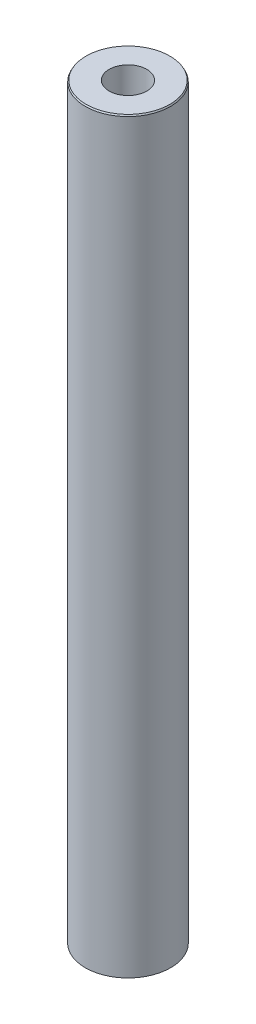
ISO-10303-21;
HEADER;
FILE_DESCRIPTION(('STEP AP214'),'2;1');
FILE_NAME('part.step','',(''),(''),'','','');
FILE_SCHEMA(('AUTOMOTIVE_DESIGN { 1 0 10303 214 1 1 1 1 }'));
ENDSEC;
DATA;
#1=APPLICATION_CONTEXT('core data for automotive mechanical design processes');
#2=APPLICATION_PROTOCOL_DEFINITION('international standard','automotive_design',2000,#1);
#3=PRODUCT_CONTEXT('',#1,'mechanical');
#4=PRODUCT('Part','Part','',(#3));
#5=PRODUCT_RELATED_PRODUCT_CATEGORY('part','',(#4));
#6=PRODUCT_DEFINITION_FORMATION('','',#4);
#7=PRODUCT_DEFINITION_CONTEXT('part definition',#1,'design');
#8=PRODUCT_DEFINITION('design','',#6,#7);
#9=PRODUCT_DEFINITION_SHAPE('','',#8);
#10=(LENGTH_UNIT() NAMED_UNIT(*) SI_UNIT(.MILLI.,.METRE.));
#11=(NAMED_UNIT(*) PLANE_ANGLE_UNIT() SI_UNIT($,.RADIAN.));
#12=(NAMED_UNIT(*) SI_UNIT($,.STERADIAN.) SOLID_ANGLE_UNIT());
#13=UNCERTAINTY_MEASURE_WITH_UNIT(LENGTH_MEASURE(1.E-05),#10,'distance_accuracy_value','');
#14=(GEOMETRIC_REPRESENTATION_CONTEXT(3) GLOBAL_UNCERTAINTY_ASSIGNED_CONTEXT((#13)) GLOBAL_UNIT_ASSIGNED_CONTEXT((#10,
#11,#12)) REPRESENTATION_CONTEXT('',''));
#15=CARTESIAN_POINT('',(0.,0.,0.));
#16=DIRECTION('',(0.,0.,1.));
#17=DIRECTION('',(1.,0.,0.));
#18=AXIS2_PLACEMENT_3D('',#15,#16,#17);
#19=CARTESIAN_POINT('',(0.,175.328501605304,0.));
#20=DIRECTION('',(0.,-1.,0.));
#21=DIRECTION('',(0.,0.,-1.));
#22=AXIS2_PLACEMENT_3D('',#19,#20,#21);
#23=CYLINDRICAL_SURFACE('',#22,10.);
#24=CARTESIAN_POINT('',(0.,175.005196018017,0.));
#25=DIRECTION('',(0.,1.,0.));
#26=DIRECTION('',(0.,0.,1.));
#27=AXIS2_PLACEMENT_3D('',#24,#25,#26);
#28=CIRCLE('',#27,10.);
#29=CARTESIAN_POINT('',(0.,175.005196018017,10.));
#30=VERTEX_POINT('',#29);
#31=EDGE_CURVE('E50',#30,#30,#28,.F.);
#32=ORIENTED_EDGE('',*,*,#31,.T.);
#33=EDGE_LOOP('',(#32));
#34=FACE_BOUND('',#33,.T.);
#35=CARTESIAN_POINT('',(0.,0.186660567850938,0.));
#36=DIRECTION('',(0.,1.,0.));
#37=DIRECTION('',(0.,0.,1.));
#38=AXIS2_PLACEMENT_3D('',#35,#36,#37);
#39=CIRCLE('',#38,10.);
#40=CARTESIAN_POINT('',(0.,0.186660567850938,10.));
#41=VERTEX_POINT('',#40);
#42=EDGE_CURVE('E51',#41,#41,#39,.T.);
#43=ORIENTED_EDGE('',*,*,#42,.T.);
#44=EDGE_LOOP('',(#43));
#45=FACE_BOUND('',#44,.T.);
#46=ADVANCED_FACE('F39',(#34,#45),#23,.T.);
#47=CARTESIAN_POINT('',(0.,175.328501605304,0.));
#48=DIRECTION('',(0.,1.,0.));
#49=DIRECTION('',(0.,0.,1.));
#50=AXIS2_PLACEMENT_3D('',#47,#48,#49);
#51=PLANE('',#50);
#52=CARTESIAN_POINT('',(0.,175.328501605304,0.));
#53=DIRECTION('',(0.,1.,0.));
#54=DIRECTION('',(0.,0.,1.));
#55=AXIS2_PLACEMENT_3D('',#52,#53,#54);
#56=CIRCLE('',#55,9.81333943214904);
#57=CARTESIAN_POINT('',(0.,175.328501605304,9.81333943214904));
#58=VERTEX_POINT('',#57);
#59=EDGE_CURVE('E54',#58,#58,#56,.T.);
#60=ORIENTED_EDGE('',*,*,#59,.T.);
#61=EDGE_LOOP('',(#60));
#62=FACE_BOUND('',#61,.T.);
#63=CARTESIAN_POINT('',(0.,175.328501605304,0.));
#64=DIRECTION('',(0.,1.,0.));
#65=DIRECTION('',(0.,0.,1.));
#66=AXIS2_PLACEMENT_3D('',#63,#64,#65);
#67=CIRCLE('',#66,4.41394839885465);
#68=CARTESIAN_POINT('',(0.,175.328501605304,4.41394839885465));
#69=VERTEX_POINT('',#68);
#70=EDGE_CURVE('E58',#69,#69,#67,.T.);
#71=ORIENTED_EDGE('',*,*,#70,.F.);
#72=EDGE_LOOP('',(#71));
#73=FACE_BOUND('',#72,.T.);
#74=ADVANCED_FACE('F69',(#62,#73),#51,.T.);
#75=CARTESIAN_POINT('',(0.,0.,0.));
#76=DIRECTION('',(0.,1.,0.));
#77=DIRECTION('',(0.,0.,1.));
#78=AXIS2_PLACEMENT_3D('',#75,#76,#77);
#79=PLANE('',#78);
#80=CARTESIAN_POINT('',(0.,0.,0.));
#81=DIRECTION('',(0.,1.,0.));
#82=DIRECTION('',(0.,0.,1.));
#83=AXIS2_PLACEMENT_3D('',#80,#81,#82);
#84=CIRCLE('',#83,9.67669441271252);
#85=CARTESIAN_POINT('',(0.,0.,9.67669441271252));
#86=VERTEX_POINT('',#85);
#87=EDGE_CURVE('E10',#86,#86,#84,.F.);
#88=ORIENTED_EDGE('',*,*,#87,.T.);
#89=EDGE_LOOP('',(#88));
#90=FACE_BOUND('',#89,.T.);
#91=CARTESIAN_POINT('',(0.,0.,0.));
#92=DIRECTION('',(0.,1.,0.));
#93=DIRECTION('',(0.,0.,1.));
#94=AXIS2_PLACEMENT_3D('',#91,#92,#93);
#95=CIRCLE('',#94,4.41394839885465);
#96=CARTESIAN_POINT('',(0.,0.,4.41394839885465));
#97=VERTEX_POINT('',#96);
#98=EDGE_CURVE('E63',#97,#97,#95,.T.);
#99=ORIENTED_EDGE('',*,*,#98,.T.);
#100=EDGE_LOOP('',(#99));
#101=FACE_BOUND('',#100,.T.);
#102=ADVANCED_FACE('F75',(#90,#101),#79,.F.);
#103=CARTESIAN_POINT('',(0.,175.328501605304,0.));
#104=DIRECTION('',(0.,-1.,0.));
#105=DIRECTION('',(0.,0.,-1.));
#106=AXIS2_PLACEMENT_3D('',#103,#104,#105);
#107=CYLINDRICAL_SURFACE('',#106,4.41394839885465);
#108=ORIENTED_EDGE('',*,*,#70,.T.);
#109=EDGE_LOOP('',(#108));
#110=FACE_BOUND('',#109,.T.);
#111=ORIENTED_EDGE('',*,*,#98,.F.);
#112=EDGE_LOOP('',(#111));
#113=FACE_BOUND('',#112,.T.);
#114=ADVANCED_FACE('F70',(#110,#113),#107,.F.);
#115=CARTESIAN_POINT('',(0.,175.328501605304,0.));
#116=DIRECTION('',(0.,-1.,0.));
#117=DIRECTION('',(0.,0.,-1.));
#118=AXIS2_PLACEMENT_3D('',#115,#116,#117);
#119=CONICAL_SURFACE('',#118,9.81333943214904,0.523598775598293);
#120=ORIENTED_EDGE('',*,*,#31,.F.);
#121=EDGE_LOOP('',(#120));
#122=FACE_BOUND('',#121,.T.);
#123=ORIENTED_EDGE('',*,*,#59,.F.);
#124=EDGE_LOOP('',(#123));
#125=FACE_BOUND('',#124,.T.);
#126=ADVANCED_FACE('F81',(#122,#125),#119,.T.);
#127=CARTESIAN_POINT('',(0.,0.186660567850938,0.));
#128=DIRECTION('',(0.,1.,0.));
#129=DIRECTION('',(0.,0.,1.));
#130=AXIS2_PLACEMENT_3D('',#127,#128,#129);
#131=CONICAL_SURFACE('',#130,10.,1.0471975511966);
#132=ORIENTED_EDGE('',*,*,#87,.F.);
#133=EDGE_LOOP('',(#132));
#134=FACE_BOUND('',#133,.T.);
#135=ORIENTED_EDGE('',*,*,#42,.F.);
#136=EDGE_LOOP('',(#135));
#137=FACE_BOUND('',#136,.T.);
#138=ADVANCED_FACE('F45',(#134,#137),#131,.T.);
#139=CLOSED_SHELL('',(#46,#74,#102,#114,#126,#138));
#140=MANIFOLD_SOLID_BREP('B2',#139);
#141=ADVANCED_BREP_SHAPE_REPRESENTATION('',(#18,#140),#14);
#142=SHAPE_DEFINITION_REPRESENTATION(#9,#141);
ENDSEC;
END-ISO-10303-21;
